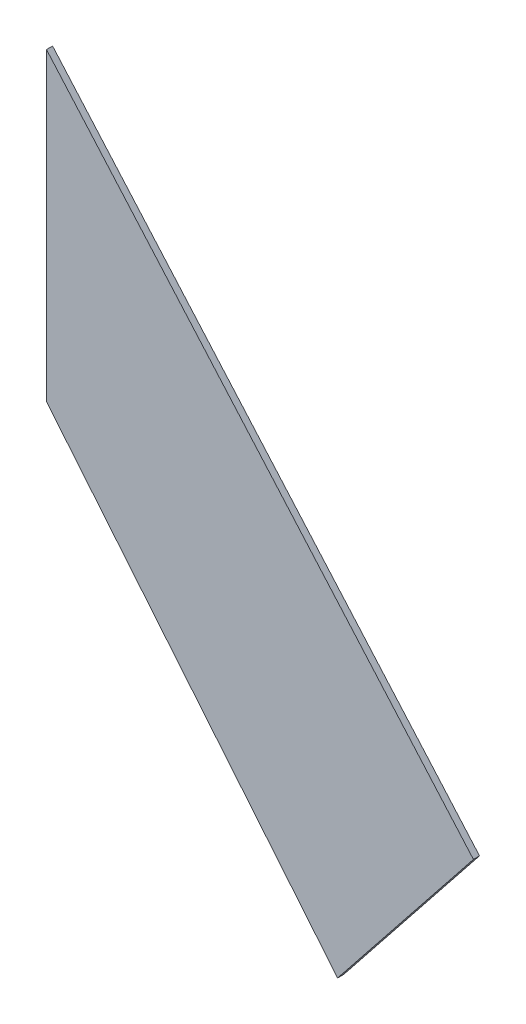
ISO-10303-21;
HEADER;
FILE_DESCRIPTION(('STEP AP214'),'2;1');
FILE_NAME('part.step','',(''),(''),'','','');
FILE_SCHEMA(('AUTOMOTIVE_DESIGN { 1 0 10303 214 1 1 1 1 }'));
ENDSEC;
DATA;
#1=APPLICATION_CONTEXT('core data for automotive mechanical design processes');
#2=APPLICATION_PROTOCOL_DEFINITION('international standard','automotive_design',2000,#1);
#3=PRODUCT_CONTEXT('',#1,'mechanical');
#4=PRODUCT('Part','Part','',(#3));
#5=PRODUCT_RELATED_PRODUCT_CATEGORY('part','',(#4));
#6=PRODUCT_DEFINITION_FORMATION('','',#4);
#7=PRODUCT_DEFINITION_CONTEXT('part definition',#1,'design');
#8=PRODUCT_DEFINITION('design','',#6,#7);
#9=PRODUCT_DEFINITION_SHAPE('','',#8);
#10=(LENGTH_UNIT() NAMED_UNIT(*) SI_UNIT(.MILLI.,.METRE.));
#11=(NAMED_UNIT(*) PLANE_ANGLE_UNIT() SI_UNIT($,.RADIAN.));
#12=(NAMED_UNIT(*) SI_UNIT($,.STERADIAN.) SOLID_ANGLE_UNIT());
#13=UNCERTAINTY_MEASURE_WITH_UNIT(LENGTH_MEASURE(1.E-05),#10,'distance_accuracy_value','');
#14=(GEOMETRIC_REPRESENTATION_CONTEXT(3) GLOBAL_UNCERTAINTY_ASSIGNED_CONTEXT((#13)) GLOBAL_UNIT_ASSIGNED_CONTEXT((#10,
#11,#12)) REPRESENTATION_CONTEXT('',''));
#15=CARTESIAN_POINT('',(0.,0.,0.));
#16=DIRECTION('',(0.,0.,1.));
#17=DIRECTION('',(1.,0.,0.));
#18=AXIS2_PLACEMENT_3D('',#15,#16,#17);
#19=CARTESIAN_POINT('',(40.3887640256659,16.0704517864015,0.1));
#20=DIRECTION('',(-0.782364165414995,0.622821252587369,0.));
#21=DIRECTION('',(-0.622821252587369,-0.782364165414995,0.));
#22=AXIS2_PLACEMENT_3D('',#19,#20,#21);
#23=PLANE('',#22);
#24=DIRECTION('',(0.622821252587369,0.782364165414995,0.));
#25=VECTOR('',#24,1.);
#26=CARTESIAN_POINT('',(40.3887640256659,16.0704517864015,0.));
#27=LINE('',#26,#25);
#28=CARTESIAN_POINT('',(40.3887640256659,16.0704517864015,0.));
#29=VERTEX_POINT('',#28);
#30=CARTESIAN_POINT('',(42.6157334253943,18.8678853174271,0.));
#31=VERTEX_POINT('',#30);
#32=EDGE_CURVE('E96',#29,#31,#27,.T.);
#33=ORIENTED_EDGE('',*,*,#32,.T.);
#34=DIRECTION('',(0.,0.,-1.));
#35=VECTOR('',#34,1.);
#36=CARTESIAN_POINT('',(42.6157334253943,18.8678853174271,0.1));
#37=LINE('',#36,#35);
#38=CARTESIAN_POINT('',(42.6157334253943,18.8678853174271,0.1));
#39=VERTEX_POINT('',#38);
#40=EDGE_CURVE('E11',#39,#31,#37,.T.);
#41=ORIENTED_EDGE('',*,*,#40,.F.);
#42=DIRECTION('',(0.622821252587369,0.782364165414995,0.));
#43=VECTOR('',#42,1.);
#44=CARTESIAN_POINT('',(40.3887640256659,16.0704517864015,0.1));
#45=LINE('',#44,#43);
#46=CARTESIAN_POINT('',(40.3887640256659,16.0704517864015,0.1));
#47=VERTEX_POINT('',#46);
#48=EDGE_CURVE('E84',#47,#39,#45,.T.);
#49=ORIENTED_EDGE('',*,*,#48,.F.);
#50=DIRECTION('',(0.,0.,-1.));
#51=VECTOR('',#50,1.);
#52=CARTESIAN_POINT('',(40.3887640256659,16.0704517864015,0.1));
#53=LINE('',#52,#51);
#54=EDGE_CURVE('E92',#47,#29,#53,.T.);
#55=ORIENTED_EDGE('',*,*,#54,.T.);
#56=EDGE_LOOP('',(#33,#41,#49,#55));
#57=FACE_BOUND('',#56,.T.);
#58=ADVANCED_FACE('F33',(#57),#23,.F.);
#59=CARTESIAN_POINT('',(42.6157334253943,18.8678853174271,0.1));
#60=DIRECTION('',(-0.752576694706878,-0.658504607868518,0.));
#61=DIRECTION('',(0.658504607868518,-0.752576694706878,0.));
#62=AXIS2_PLACEMENT_3D('',#59,#60,#61);
#63=PLANE('',#62);
#64=DIRECTION('',(-0.658504607868518,0.752576694706878,0.));
#65=VECTOR('',#64,1.);
#66=CARTESIAN_POINT('',(42.6157334253943,18.8678853174271,0.));
#67=LINE('',#66,#65);
#68=CARTESIAN_POINT('',(35.6157334253943,26.8678853174271,0.));
#69=VERTEX_POINT('',#68);
#70=EDGE_CURVE('E88',#31,#69,#67,.T.);
#71=ORIENTED_EDGE('',*,*,#70,.T.);
#72=DIRECTION('',(0.,0.,-1.));
#73=VECTOR('',#72,1.);
#74=CARTESIAN_POINT('',(35.6157334253943,26.8678853174271,0.1));
#75=LINE('',#74,#73);
#76=CARTESIAN_POINT('',(35.6157334253943,26.8678853174271,0.1));
#77=VERTEX_POINT('',#76);
#78=EDGE_CURVE('E41',#77,#69,#75,.T.);
#79=ORIENTED_EDGE('',*,*,#78,.F.);
#80=DIRECTION('',(-0.658504607868518,0.752576694706878,0.));
#81=VECTOR('',#80,1.);
#82=CARTESIAN_POINT('',(42.6157334253943,18.8678853174271,0.1));
#83=LINE('',#82,#81);
#84=EDGE_CURVE('E79',#39,#77,#83,.T.);
#85=ORIENTED_EDGE('',*,*,#84,.F.);
#86=ORIENTED_EDGE('',*,*,#40,.T.);
#87=EDGE_LOOP('',(#71,#79,#85,#86));
#88=FACE_BOUND('',#87,.T.);
#89=ADVANCED_FACE('F87',(#88),#63,.F.);
#90=CARTESIAN_POINT('',(35.6157334253943,26.8678853174271,0.1));
#91=DIRECTION('',(1.,0.,0.));
#92=DIRECTION('',(0.,0.,-1.));
#93=AXIS2_PLACEMENT_3D('',#90,#91,#92);
#94=PLANE('',#93);
#95=DIRECTION('',(0.,-1.,0.));
#96=VECTOR('',#95,1.);
#97=CARTESIAN_POINT('',(35.6157334253943,26.8678853174271,0.));
#98=LINE('',#97,#96);
#99=CARTESIAN_POINT('',(35.6157334253943,21.8678853174271,0.));
#100=VERTEX_POINT('',#99);
#101=EDGE_CURVE('E66',#69,#100,#98,.T.);
#102=ORIENTED_EDGE('',*,*,#101,.T.);
#103=DIRECTION('',(0.,0.,-1.));
#104=VECTOR('',#103,1.);
#105=CARTESIAN_POINT('',(35.6157334253943,21.8678853174271,0.1));
#106=LINE('',#105,#104);
#107=CARTESIAN_POINT('',(35.6157334253943,21.8678853174271,0.1));
#108=VERTEX_POINT('',#107);
#109=EDGE_CURVE('E89',#108,#100,#106,.T.);
#110=ORIENTED_EDGE('',*,*,#109,.F.);
#111=DIRECTION('',(0.,-1.,0.));
#112=VECTOR('',#111,1.);
#113=CARTESIAN_POINT('',(35.6157334253943,26.8678853174271,0.1));
#114=LINE('',#113,#112);
#115=EDGE_CURVE('E82',#77,#108,#114,.T.);
#116=ORIENTED_EDGE('',*,*,#115,.F.);
#117=ORIENTED_EDGE('',*,*,#78,.T.);
#118=EDGE_LOOP('',(#102,#110,#116,#117));
#119=FACE_BOUND('',#118,.T.);
#120=ADVANCED_FACE('F90',(#119),#94,.F.);
#121=CARTESIAN_POINT('',(35.6157334253943,21.8678853174271,0.1));
#122=DIRECTION('',(0.772016906473416,0.635601995056038,0.));
#123=DIRECTION('',(-0.635601995056038,0.772016906473417,0.));
#124=AXIS2_PLACEMENT_3D('',#121,#122,#123);
#125=PLANE('',#124);
#126=DIRECTION('',(0.635601995056038,-0.772016906473416,0.));
#127=VECTOR('',#126,1.);
#128=CARTESIAN_POINT('',(35.6157334253943,21.8678853174271,0.));
#129=LINE('',#128,#127);
#130=EDGE_CURVE('E72',#100,#29,#129,.T.);
#131=ORIENTED_EDGE('',*,*,#130,.T.);
#132=ORIENTED_EDGE('',*,*,#54,.F.);
#133=DIRECTION('',(0.635601995056038,-0.772016906473416,0.));
#134=VECTOR('',#133,1.);
#135=CARTESIAN_POINT('',(35.6157334253943,21.8678853174271,0.1));
#136=LINE('',#135,#134);
#137=EDGE_CURVE('E49',#108,#47,#136,.T.);
#138=ORIENTED_EDGE('',*,*,#137,.F.);
#139=ORIENTED_EDGE('',*,*,#109,.T.);
#140=EDGE_LOOP('',(#131,#132,#138,#139));
#141=FACE_BOUND('',#140,.T.);
#142=ADVANCED_FACE('F103',(#141),#125,.F.);
#143=CARTESIAN_POINT('',(0.,0.,0.1));
#144=DIRECTION('',(0.,0.,1.));
#145=DIRECTION('',(1.,0.,0.));
#146=AXIS2_PLACEMENT_3D('',#143,#144,#145);
#147=PLANE('',#146);
#148=ORIENTED_EDGE('',*,*,#48,.T.);
#149=ORIENTED_EDGE('',*,*,#84,.T.);
#150=ORIENTED_EDGE('',*,*,#115,.T.);
#151=ORIENTED_EDGE('',*,*,#137,.T.);
#152=EDGE_LOOP('',(#148,#149,#150,#151));
#153=FACE_BOUND('',#152,.T.);
#154=ADVANCED_FACE('F80',(#153),#147,.T.);
#155=CARTESIAN_POINT('',(0.,0.,0.));
#156=DIRECTION('',(0.,0.,1.));
#157=DIRECTION('',(1.,0.,0.));
#158=AXIS2_PLACEMENT_3D('',#155,#156,#157);
#159=PLANE('',#158);
#160=ORIENTED_EDGE('',*,*,#32,.F.);
#161=ORIENTED_EDGE('',*,*,#130,.F.);
#162=ORIENTED_EDGE('',*,*,#101,.F.);
#163=ORIENTED_EDGE('',*,*,#70,.F.);
#164=EDGE_LOOP('',(#160,#161,#162,#163));
#165=FACE_BOUND('',#164,.T.);
#166=ADVANCED_FACE('F106',(#165),#159,.F.);
#167=CLOSED_SHELL('',(#58,#89,#120,#142,#154,#166));
#168=MANIFOLD_SOLID_BREP('B2',#167);
#169=ADVANCED_BREP_SHAPE_REPRESENTATION('',(#18,#168),#14);
#170=SHAPE_DEFINITION_REPRESENTATION(#9,#169);
ENDSEC;
END-ISO-10303-21;
